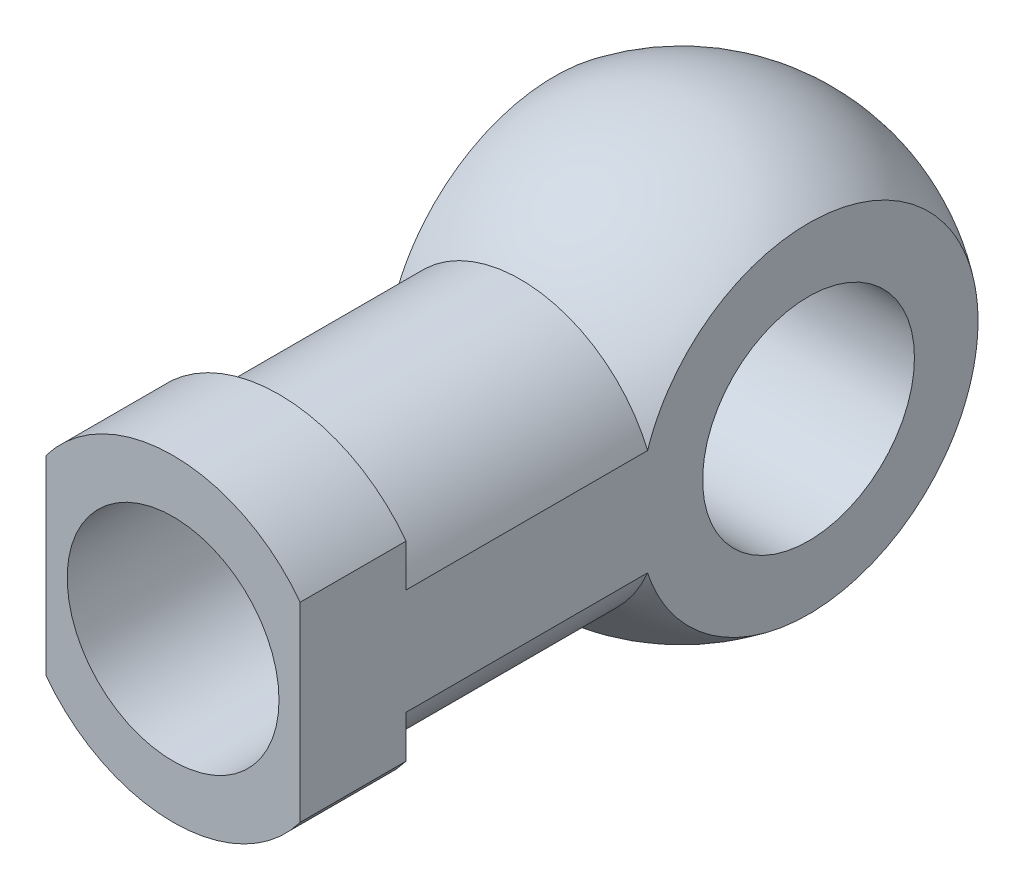
ISO-10303-21;
HEADER;
FILE_DESCRIPTION(('STEP AP214'),'2;1');
FILE_NAME('part.step','',(''),(''),'','','');
FILE_SCHEMA(('AUTOMOTIVE_DESIGN { 1 0 10303 214 1 1 1 1 }'));
ENDSEC;
DATA;
#1=APPLICATION_CONTEXT('core data for automotive mechanical design processes');
#2=APPLICATION_PROTOCOL_DEFINITION('international standard','automotive_design',2000,#1);
#3=PRODUCT_CONTEXT('',#1,'mechanical');
#4=PRODUCT('Part','Part','',(#3));
#5=PRODUCT_RELATED_PRODUCT_CATEGORY('part','',(#4));
#6=PRODUCT_DEFINITION_FORMATION('','',#4);
#7=PRODUCT_DEFINITION_CONTEXT('part definition',#1,'design');
#8=PRODUCT_DEFINITION('design','',#6,#7);
#9=PRODUCT_DEFINITION_SHAPE('','',#8);
#10=(LENGTH_UNIT() NAMED_UNIT(*) SI_UNIT(.MILLI.,.METRE.));
#11=(NAMED_UNIT(*) PLANE_ANGLE_UNIT() SI_UNIT($,.RADIAN.));
#12=(NAMED_UNIT(*) SI_UNIT($,.STERADIAN.) SOLID_ANGLE_UNIT());
#13=UNCERTAINTY_MEASURE_WITH_UNIT(LENGTH_MEASURE(1.E-05),#10,'distance_accuracy_value','');
#14=(GEOMETRIC_REPRESENTATION_CONTEXT(3) GLOBAL_UNCERTAINTY_ASSIGNED_CONTEXT((#13)) GLOBAL_UNIT_ASSIGNED_CONTEXT((#10,
#11,#12)) REPRESENTATION_CONTEXT('',''));
#15=CARTESIAN_POINT('',(0.,0.,0.));
#16=DIRECTION('',(0.,0.,1.));
#17=DIRECTION('',(1.,0.,0.));
#18=AXIS2_PLACEMENT_3D('',#15,#16,#17);
#19=CARTESIAN_POINT('',(0.,0.,5.));
#20=DIRECTION('',(0.,0.,1.));
#21=DIRECTION('',(1.,0.,0.));
#22=AXIS2_PLACEMENT_3D('',#19,#20,#21);
#23=PLANE('',#22);
#24=CARTESIAN_POINT('',(0.,0.,5.));
#25=DIRECTION('',(0.,0.,1.));
#26=DIRECTION('',(1.,0.,0.));
#27=AXIS2_PLACEMENT_3D('',#24,#25,#26);
#28=CIRCLE('',#27,5.);
#29=CARTESIAN_POINT('',(5.,0.,5.));
#30=VERTEX_POINT('',#29);
#31=EDGE_CURVE('E125',#30,#30,#28,.T.);
#32=ORIENTED_EDGE('',*,*,#31,.F.);
#33=EDGE_LOOP('',(#32));
#34=FACE_BOUND('',#33,.T.);
#35=CARTESIAN_POINT('',(0.,0.,5.));
#36=DIRECTION('',(0.,0.,1.));
#37=DIRECTION('',(1.,0.,0.));
#38=AXIS2_PLACEMENT_3D('',#35,#36,#37);
#39=CIRCLE('',#38,7.5);
#40=CARTESIAN_POINT('',(-6.,-4.5,5.));
#41=VERTEX_POINT('',#40);
#42=CARTESIAN_POINT('',(6.,-4.5,5.));
#43=VERTEX_POINT('',#42);
#44=EDGE_CURVE('E118',#41,#43,#39,.T.);
#45=ORIENTED_EDGE('',*,*,#44,.T.);
#46=DIRECTION('',(0.,1.,0.));
#47=VECTOR('',#46,1.);
#48=CARTESIAN_POINT('',(6.,-10.6812395399353,5.));
#49=LINE('',#48,#47);
#50=CARTESIAN_POINT('',(6.,4.5,5.));
#51=VERTEX_POINT('',#50);
#52=EDGE_CURVE('E105',#43,#51,#49,.T.);
#53=ORIENTED_EDGE('',*,*,#52,.T.);
#54=CARTESIAN_POINT('',(-6.,4.5,5.));
#55=VERTEX_POINT('',#54);
#56=EDGE_CURVE('E112',#51,#55,#39,.T.);
#57=ORIENTED_EDGE('',*,*,#56,.T.);
#58=DIRECTION('',(0.,-1.,0.));
#59=VECTOR('',#58,1.);
#60=CARTESIAN_POINT('',(-6.,-10.6812395399353,5.));
#61=LINE('',#60,#59);
#62=EDGE_CURVE('E94',#55,#41,#61,.T.);
#63=ORIENTED_EDGE('',*,*,#62,.T.);
#64=EDGE_LOOP('',(#45,#53,#57,#63));
#65=FACE_BOUND('',#64,.T.);
#66=ADVANCED_FACE('F32',(#34,#65),#23,.T.);
#67=CARTESIAN_POINT('',(0.,0.,0.));
#68=DIRECTION('',(0.,0.,1.));
#69=DIRECTION('',(1.,0.,0.));
#70=AXIS2_PLACEMENT_3D('',#67,#68,#69);
#71=PLANE('',#70);
#72=DIRECTION('',(0.,1.,0.));
#73=VECTOR('',#72,1.);
#74=CARTESIAN_POINT('',(6.,0.,0.));
#75=LINE('',#74,#73);
#76=CARTESIAN_POINT('',(6.,-4.5,0.));
#77=VERTEX_POINT('',#76);
#78=CARTESIAN_POINT('',(6.,-2.5,0.));
#79=VERTEX_POINT('',#78);
#80=EDGE_CURVE('E148',#77,#79,#75,.T.);
#81=ORIENTED_EDGE('',*,*,#80,.F.);
#82=CARTESIAN_POINT('',(0.,0.,0.));
#83=DIRECTION('',(0.,0.,1.));
#84=DIRECTION('',(1.,0.,0.));
#85=AXIS2_PLACEMENT_3D('',#82,#83,#84);
#86=CIRCLE('',#85,7.5);
#87=CARTESIAN_POINT('',(-6.,-4.5,0.));
#88=VERTEX_POINT('',#87);
#89=EDGE_CURVE('E127',#88,#77,#86,.T.);
#90=ORIENTED_EDGE('',*,*,#89,.F.);
#91=DIRECTION('',(0.,-1.,0.));
#92=VECTOR('',#91,1.);
#93=CARTESIAN_POINT('',(-6.,0.,0.));
#94=LINE('',#93,#92);
#95=CARTESIAN_POINT('',(-6.,-2.5,0.));
#96=VERTEX_POINT('',#95);
#97=EDGE_CURVE('E157',#96,#88,#94,.T.);
#98=ORIENTED_EDGE('',*,*,#97,.F.);
#99=CARTESIAN_POINT('',(0.,0.,0.));
#100=DIRECTION('',(0.,0.,1.));
#101=DIRECTION('',(1.,0.,0.));
#102=AXIS2_PLACEMENT_3D('',#99,#100,#101);
#103=CIRCLE('',#102,6.5);
#104=EDGE_CURVE('E121',#79,#96,#103,.F.);
#105=ORIENTED_EDGE('',*,*,#104,.F.);
#106=EDGE_LOOP('',(#81,#90,#98,#105));
#107=FACE_BOUND('',#106,.T.);
#108=ADVANCED_FACE('F190',(#107),#71,.F.);
#109=CARTESIAN_POINT('',(6.,2.5,0.));
#110=VERTEX_POINT('',#109);
#111=CARTESIAN_POINT('',(6.,4.5,0.));
#112=VERTEX_POINT('',#111);
#113=EDGE_CURVE('E151',#110,#112,#75,.T.);
#114=ORIENTED_EDGE('',*,*,#113,.F.);
#115=CARTESIAN_POINT('',(-6.,2.5,0.));
#116=VERTEX_POINT('',#115);
#117=EDGE_CURVE('E117',#116,#110,#103,.F.);
#118=ORIENTED_EDGE('',*,*,#117,.F.);
#119=CARTESIAN_POINT('',(-6.,4.5,0.));
#120=VERTEX_POINT('',#119);
#121=EDGE_CURVE('E156',#120,#116,#94,.T.);
#122=ORIENTED_EDGE('',*,*,#121,.F.);
#123=EDGE_CURVE('E114',#112,#120,#86,.T.);
#124=ORIENTED_EDGE('',*,*,#123,.F.);
#125=EDGE_LOOP('',(#114,#118,#122,#124));
#126=FACE_BOUND('',#125,.T.);
#127=ADVANCED_FACE('F196',(#126),#71,.F.);
#128=CARTESIAN_POINT('',(0.,0.,5.));
#129=DIRECTION('',(0.,0.,-1.));
#130=DIRECTION('',(-1.,0.,0.));
#131=AXIS2_PLACEMENT_3D('',#128,#129,#130);
#132=CYLINDRICAL_SURFACE('',#131,7.5);
#133=DIRECTION('',(0.,0.,-1.));
#134=VECTOR('',#133,1.);
#135=CARTESIAN_POINT('',(6.,-4.5,5.));
#136=LINE('',#135,#134);
#137=EDGE_CURVE('E144',#43,#77,#136,.T.);
#138=ORIENTED_EDGE('',*,*,#137,.F.);
#139=ORIENTED_EDGE('',*,*,#44,.F.);
#140=DIRECTION('',(0.,0.,-1.));
#141=VECTOR('',#140,1.);
#142=CARTESIAN_POINT('',(-6.,-4.5,5.));
#143=LINE('',#142,#141);
#144=EDGE_CURVE('E100',#88,#41,#143,.F.);
#145=ORIENTED_EDGE('',*,*,#144,.F.);
#146=ORIENTED_EDGE('',*,*,#89,.T.);
#147=EDGE_LOOP('',(#138,#139,#145,#146));
#148=FACE_BOUND('',#147,.T.);
#149=ADVANCED_FACE('F34',(#148),#132,.T.);
#150=DIRECTION('',(0.,0.,-1.));
#151=VECTOR('',#150,1.);
#152=CARTESIAN_POINT('',(6.,4.5,5.));
#153=LINE('',#152,#151);
#154=EDGE_CURVE('E145',#112,#51,#153,.F.);
#155=ORIENTED_EDGE('',*,*,#154,.F.);
#156=ORIENTED_EDGE('',*,*,#123,.T.);
#157=DIRECTION('',(0.,0.,-1.));
#158=VECTOR('',#157,1.);
#159=CARTESIAN_POINT('',(-6.,4.5,5.));
#160=LINE('',#159,#158);
#161=EDGE_CURVE('E97',#55,#120,#160,.T.);
#162=ORIENTED_EDGE('',*,*,#161,.F.);
#163=ORIENTED_EDGE('',*,*,#56,.F.);
#164=EDGE_LOOP('',(#155,#156,#162,#163));
#165=FACE_BOUND('',#164,.T.);
#166=ADVANCED_FACE('F111',(#165),#132,.T.);
#167=CARTESIAN_POINT('',(0.,0.,-19.));
#168=DIRECTION('',(0.,0.,1.));
#169=DIRECTION('',(1.,0.,0.));
#170=AXIS2_PLACEMENT_3D('',#167,#168,#169);
#171=CYLINDRICAL_SURFACE('',#170,6.5);
#172=DIRECTION('',(0.,0.,1.));
#173=VECTOR('',#172,1.);
#174=CARTESIAN_POINT('',(6.,2.5,-19.));
#175=LINE('',#174,#173);
#176=CARTESIAN_POINT('',(6.,2.5,-11.4006579232147));
#177=VERTEX_POINT('',#176);
#178=EDGE_CURVE('E143',#177,#110,#175,.T.);
#179=ORIENTED_EDGE('',*,*,#178,.F.);
#180=CARTESIAN_POINT('',(0.,0.,-11.4006579232147));
#181=DIRECTION('',(0.,0.,-1.));
#182=DIRECTION('',(-1.,0.,0.));
#183=AXIS2_PLACEMENT_3D('',#180,#181,#182);
#184=CIRCLE('',#183,6.5);
#185=CARTESIAN_POINT('',(-6.,2.5,-11.4006579232147));
#186=VERTEX_POINT('',#185);
#187=EDGE_CURVE('E132',#177,#186,#184,.F.);
#188=ORIENTED_EDGE('',*,*,#187,.T.);
#189=DIRECTION('',(0.,0.,1.));
#190=VECTOR('',#189,1.);
#191=CARTESIAN_POINT('',(-6.,2.5,-19.));
#192=LINE('',#191,#190);
#193=EDGE_CURVE('E47',#116,#186,#192,.F.);
#194=ORIENTED_EDGE('',*,*,#193,.F.);
#195=ORIENTED_EDGE('',*,*,#117,.T.);
#196=EDGE_LOOP('',(#179,#188,#194,#195));
#197=FACE_BOUND('',#196,.T.);
#198=ADVANCED_FACE('F141',(#197),#171,.T.);
#199=DIRECTION('',(0.,0.,1.));
#200=VECTOR('',#199,1.);
#201=CARTESIAN_POINT('',(6.,-2.5,-19.));
#202=LINE('',#201,#200);
#203=CARTESIAN_POINT('',(6.,-2.5,-11.4006579232147));
#204=VERTEX_POINT('',#203);
#205=EDGE_CURVE('E55',#79,#204,#202,.F.);
#206=ORIENTED_EDGE('',*,*,#205,.F.);
#207=ORIENTED_EDGE('',*,*,#104,.T.);
#208=DIRECTION('',(0.,0.,1.));
#209=VECTOR('',#208,1.);
#210=CARTESIAN_POINT('',(-6.,-2.5,-19.));
#211=LINE('',#210,#209);
#212=CARTESIAN_POINT('',(-6.,-2.5,-11.4006579232147));
#213=VERTEX_POINT('',#212);
#214=EDGE_CURVE('E159',#213,#96,#211,.T.);
#215=ORIENTED_EDGE('',*,*,#214,.F.);
#216=EDGE_CURVE('E130',#213,#204,#184,.F.);
#217=ORIENTED_EDGE('',*,*,#216,.T.);
#218=EDGE_LOOP('',(#206,#207,#215,#217));
#219=FACE_BOUND('',#218,.T.);
#220=ADVANCED_FACE('F204',(#219),#171,.T.);
#221=CARTESIAN_POINT('',(0.,0.,-19.));
#222=DIRECTION('',(0.,0.,-1.));
#223=DIRECTION('',(1.,0.,0.));
#224=AXIS2_PLACEMENT_3D('',#221,#222,#223);
#225=SPHERICAL_SURFACE('',#224,10.);
#226=ORIENTED_EDGE('',*,*,#187,.F.);
#227=CARTESIAN_POINT('',(6.,0.,-19.));
#228=DIRECTION('',(1.,0.,0.));
#229=DIRECTION('',(0.,0.,-1.));
#230=AXIS2_PLACEMENT_3D('',#227,#228,#229);
#231=CIRCLE('',#230,8.);
#232=EDGE_CURVE('E11',#177,#204,#231,.F.);
#233=ORIENTED_EDGE('',*,*,#232,.T.);
#234=ORIENTED_EDGE('',*,*,#216,.F.);
#235=CARTESIAN_POINT('',(-6.,0.,-19.));
#236=DIRECTION('',(-1.,0.,0.));
#237=DIRECTION('',(0.,0.,1.));
#238=AXIS2_PLACEMENT_3D('',#235,#236,#237);
#239=CIRCLE('',#238,8.);
#240=EDGE_CURVE('E40',#213,#186,#239,.F.);
#241=ORIENTED_EDGE('',*,*,#240,.T.);
#242=EDGE_LOOP('',(#226,#233,#234,#241));
#243=FACE_BOUND('',#242,.T.);
#244=ADVANCED_FACE('F137',(#243),#225,.T.);
#245=CARTESIAN_POINT('',(0.,0.,5.));
#246=DIRECTION('',(0.,0.,-1.));
#247=DIRECTION('',(-1.,0.,0.));
#248=AXIS2_PLACEMENT_3D('',#245,#246,#247);
#249=CYLINDRICAL_SURFACE('',#248,5.);
#250=ORIENTED_EDGE('',*,*,#31,.T.);
#251=EDGE_LOOP('',(#250));
#252=FACE_BOUND('',#251,.T.);
#253=CARTESIAN_POINT('',(0.,0.,-4.99999999999999));
#254=DIRECTION('',(0.,0.,1.));
#255=DIRECTION('',(1.,0.,0.));
#256=AXIS2_PLACEMENT_3D('',#253,#254,#255);
#257=CIRCLE('',#256,5.);
#258=CARTESIAN_POINT('',(5.,0.,-4.99999999999999));
#259=VERTEX_POINT('',#258);
#260=EDGE_CURVE('E163',#259,#259,#257,.T.);
#261=ORIENTED_EDGE('',*,*,#260,.F.);
#262=EDGE_LOOP('',(#261));
#263=FACE_BOUND('',#262,.T.);
#264=ADVANCED_FACE('F185',(#252,#263),#249,.F.);
#265=CARTESIAN_POINT('',(-6.,-10.6812395399353,-33.));
#266=DIRECTION('',(-1.,0.,0.));
#267=DIRECTION('',(0.,0.,1.));
#268=AXIS2_PLACEMENT_3D('',#265,#266,#267);
#269=PLANE('',#268);
#270=CARTESIAN_POINT('',(-6.,0.,-19.));
#271=DIRECTION('',(-1.,0.,0.));
#272=DIRECTION('',(0.,0.,1.));
#273=AXIS2_PLACEMENT_3D('',#270,#271,#272);
#274=CIRCLE('',#273,5.);
#275=CARTESIAN_POINT('',(-6.,0.,-14.));
#276=VERTEX_POINT('',#275);
#277=EDGE_CURVE('E166',#276,#276,#274,.T.);
#278=ORIENTED_EDGE('',*,*,#277,.F.);
#279=EDGE_LOOP('',(#278));
#280=FACE_BOUND('',#279,.T.);
#281=ORIENTED_EDGE('',*,*,#161,.T.);
#282=ORIENTED_EDGE('',*,*,#121,.T.);
#283=ORIENTED_EDGE('',*,*,#193,.T.);
#284=ORIENTED_EDGE('',*,*,#240,.F.);
#285=ORIENTED_EDGE('',*,*,#214,.T.);
#286=ORIENTED_EDGE('',*,*,#97,.T.);
#287=ORIENTED_EDGE('',*,*,#144,.T.);
#288=ORIENTED_EDGE('',*,*,#62,.F.);
#289=EDGE_LOOP('',(#281,#282,#283,#284,#285,#286,#287,#288));
#290=FACE_BOUND('',#289,.T.);
#291=ADVANCED_FACE('F96',(#280,#290),#269,.T.);
#292=CARTESIAN_POINT('',(6.,-10.6812395399353,-33.));
#293=DIRECTION('',(1.,0.,0.));
#294=DIRECTION('',(0.,0.,-1.));
#295=AXIS2_PLACEMENT_3D('',#292,#293,#294);
#296=PLANE('',#295);
#297=CARTESIAN_POINT('',(6.,0.,-19.));
#298=DIRECTION('',(1.,0.,0.));
#299=DIRECTION('',(0.,0.,-1.));
#300=AXIS2_PLACEMENT_3D('',#297,#298,#299);
#301=CIRCLE('',#300,5.);
#302=CARTESIAN_POINT('',(6.,0.,-24.));
#303=VERTEX_POINT('',#302);
#304=EDGE_CURVE('E169',#303,#303,#301,.T.);
#305=ORIENTED_EDGE('',*,*,#304,.F.);
#306=EDGE_LOOP('',(#305));
#307=FACE_BOUND('',#306,.T.);
#308=ORIENTED_EDGE('',*,*,#137,.T.);
#309=ORIENTED_EDGE('',*,*,#80,.T.);
#310=ORIENTED_EDGE('',*,*,#205,.T.);
#311=ORIENTED_EDGE('',*,*,#232,.F.);
#312=ORIENTED_EDGE('',*,*,#178,.T.);
#313=ORIENTED_EDGE('',*,*,#113,.T.);
#314=ORIENTED_EDGE('',*,*,#154,.T.);
#315=ORIENTED_EDGE('',*,*,#52,.F.);
#316=EDGE_LOOP('',(#308,#309,#310,#311,#312,#313,#314,#315));
#317=FACE_BOUND('',#316,.T.);
#318=ADVANCED_FACE('F175',(#307,#317),#296,.T.);
#319=CARTESIAN_POINT('',(0.,0.,-4.99999999999999));
#320=DIRECTION('',(0.,0.,1.));
#321=DIRECTION('',(1.,0.,0.));
#322=AXIS2_PLACEMENT_3D('',#319,#320,#321);
#323=PLANE('',#322);
#324=ORIENTED_EDGE('',*,*,#260,.T.);
#325=EDGE_LOOP('',(#324));
#326=FACE_BOUND('',#325,.T.);
#327=ADVANCED_FACE('F177',(#326),#323,.T.);
#328=CARTESIAN_POINT('',(-31.,0.,-19.));
#329=DIRECTION('',(1.,0.,0.));
#330=DIRECTION('',(0.,0.,-1.));
#331=AXIS2_PLACEMENT_3D('',#328,#329,#330);
#332=CYLINDRICAL_SURFACE('',#331,5.);
#333=ORIENTED_EDGE('',*,*,#277,.T.);
#334=EDGE_LOOP('',(#333));
#335=FACE_BOUND('',#334,.T.);
#336=ORIENTED_EDGE('',*,*,#304,.T.);
#337=EDGE_LOOP('',(#336));
#338=FACE_BOUND('',#337,.T.);
#339=ADVANCED_FACE('F173',(#335,#338),#332,.F.);
#340=CLOSED_SHELL('',(#66,#108,#127,#149,#166,#198,#220,#244,#264,#291,#318,#327,#339));
#341=MANIFOLD_SOLID_BREP('B2',#340);
#342=ADVANCED_BREP_SHAPE_REPRESENTATION('',(#18,#341),#14);
#343=SHAPE_DEFINITION_REPRESENTATION(#9,#342);
ENDSEC;
END-ISO-10303-21;
